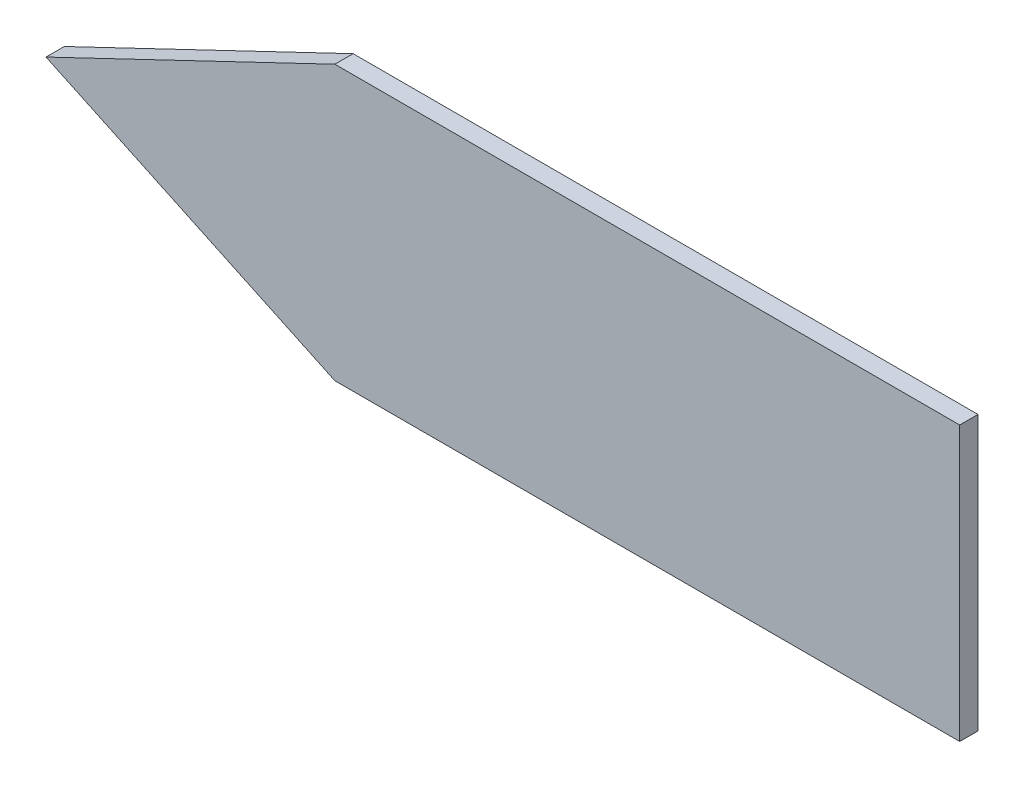
ISO-10303-21;
HEADER;
FILE_DESCRIPTION(('STEP AP214'),'2;1');
FILE_NAME('part.step','',(''),(''),'','','');
FILE_SCHEMA(('AUTOMOTIVE_DESIGN { 1 0 10303 214 1 1 1 1 }'));
ENDSEC;
DATA;
#1=APPLICATION_CONTEXT('core data for automotive mechanical design processes');
#2=APPLICATION_PROTOCOL_DEFINITION('international standard','automotive_design',2000,#1);
#3=PRODUCT_CONTEXT('',#1,'mechanical');
#4=PRODUCT('Part','Part','',(#3));
#5=PRODUCT_RELATED_PRODUCT_CATEGORY('part','',(#4));
#6=PRODUCT_DEFINITION_FORMATION('','',#4);
#7=PRODUCT_DEFINITION_CONTEXT('part definition',#1,'design');
#8=PRODUCT_DEFINITION('design','',#6,#7);
#9=PRODUCT_DEFINITION_SHAPE('','',#8);
#10=(LENGTH_UNIT() NAMED_UNIT(*) SI_UNIT(.MILLI.,.METRE.));
#11=(NAMED_UNIT(*) PLANE_ANGLE_UNIT() SI_UNIT($,.RADIAN.));
#12=(NAMED_UNIT(*) SI_UNIT($,.STERADIAN.) SOLID_ANGLE_UNIT());
#13=UNCERTAINTY_MEASURE_WITH_UNIT(LENGTH_MEASURE(1.E-05),#10,'distance_accuracy_value','');
#14=(GEOMETRIC_REPRESENTATION_CONTEXT(3) GLOBAL_UNCERTAINTY_ASSIGNED_CONTEXT((#13)) GLOBAL_UNIT_ASSIGNED_CONTEXT((#10,
#11,#12)) REPRESENTATION_CONTEXT('',''));
#15=CARTESIAN_POINT('',(0.,0.,0.));
#16=DIRECTION('',(0.,0.,1.));
#17=DIRECTION('',(1.,0.,0.));
#18=AXIS2_PLACEMENT_3D('',#15,#16,#17);
#19=CARTESIAN_POINT('',(0.,0.,1.));
#20=DIRECTION('',(0.42572241959902,0.90485381219883,0.));
#21=DIRECTION('',(-0.90485381219883,0.42572241959902,0.));
#22=AXIS2_PLACEMENT_3D('',#19,#20,#21);
#23=PLANE('',#22);
#24=DIRECTION('',(0.904853812198831,-0.42572241959902,0.));
#25=VECTOR('',#24,1.);
#26=CARTESIAN_POINT('',(0.,0.,0.));
#27=LINE('',#26,#25);
#28=CARTESIAN_POINT('',(0.,0.,0.));
#29=VERTEX_POINT('',#28);
#30=CARTESIAN_POINT('',(15.8068903472595,-7.43694452545779,0.));
#31=VERTEX_POINT('',#30);
#32=EDGE_CURVE('E106',#29,#31,#27,.T.);
#33=ORIENTED_EDGE('',*,*,#32,.T.);
#34=DIRECTION('',(0.,0.,-1.));
#35=VECTOR('',#34,1.);
#36=CARTESIAN_POINT('',(15.8068903472595,-7.43694452545779,1.));
#37=LINE('',#36,#35);
#38=CARTESIAN_POINT('',(15.8068903472595,-7.43694452545779,1.));
#39=VERTEX_POINT('',#38);
#40=EDGE_CURVE('E11',#39,#31,#37,.T.);
#41=ORIENTED_EDGE('',*,*,#40,.F.);
#42=DIRECTION('',(0.904853812198831,-0.42572241959902,0.));
#43=VECTOR('',#42,1.);
#44=CARTESIAN_POINT('',(0.,0.,1.));
#45=LINE('',#44,#43);
#46=CARTESIAN_POINT('',(0.,0.,1.));
#47=VERTEX_POINT('',#46);
#48=EDGE_CURVE('E114',#47,#39,#45,.T.);
#49=ORIENTED_EDGE('',*,*,#48,.F.);
#50=DIRECTION('',(0.,0.,-1.));
#51=VECTOR('',#50,1.);
#52=CARTESIAN_POINT('',(0.,0.,1.));
#53=LINE('',#52,#51);
#54=EDGE_CURVE('E102',#47,#29,#53,.T.);
#55=ORIENTED_EDGE('',*,*,#54,.T.);
#56=EDGE_LOOP('',(#33,#41,#49,#55));
#57=FACE_BOUND('',#56,.T.);
#58=ADVANCED_FACE('F32',(#57),#23,.F.);
#59=CARTESIAN_POINT('',(15.8068903472595,-7.43694452545779,1.));
#60=DIRECTION('',(0.,1.,0.));
#61=DIRECTION('',(0.,0.,1.));
#62=AXIS2_PLACEMENT_3D('',#59,#60,#61);
#63=PLANE('',#62);
#64=DIRECTION('',(1.,0.,0.));
#65=VECTOR('',#64,1.);
#66=CARTESIAN_POINT('',(15.8068903472595,-7.43694452545779,0.));
#67=LINE('',#66,#65);
#68=CARTESIAN_POINT('',(50.,-7.43694452545779,0.));
#69=VERTEX_POINT('',#68);
#70=EDGE_CURVE('E109',#31,#69,#67,.T.);
#71=ORIENTED_EDGE('',*,*,#70,.T.);
#72=DIRECTION('',(0.,0.,-1.));
#73=VECTOR('',#72,1.);
#74=CARTESIAN_POINT('',(50.,-7.43694452545779,1.));
#75=LINE('',#74,#73);
#76=CARTESIAN_POINT('',(50.,-7.43694452545779,1.));
#77=VERTEX_POINT('',#76);
#78=EDGE_CURVE('E40',#77,#69,#75,.T.);
#79=ORIENTED_EDGE('',*,*,#78,.F.);
#80=DIRECTION('',(1.,0.,0.));
#81=VECTOR('',#80,1.);
#82=CARTESIAN_POINT('',(15.8068903472595,-7.43694452545779,1.));
#83=LINE('',#82,#81);
#84=EDGE_CURVE('E82',#39,#77,#83,.T.);
#85=ORIENTED_EDGE('',*,*,#84,.F.);
#86=ORIENTED_EDGE('',*,*,#40,.T.);
#87=EDGE_LOOP('',(#71,#79,#85,#86));
#88=FACE_BOUND('',#87,.T.);
#89=ADVANCED_FACE('F133',(#88),#63,.F.);
#90=CARTESIAN_POINT('',(50.,-7.43694452545779,1.));
#91=DIRECTION('',(-1.,0.,0.));
#92=DIRECTION('',(0.,-1.,0.));
#93=AXIS2_PLACEMENT_3D('',#90,#91,#92);
#94=PLANE('',#93);
#95=DIRECTION('',(0.,1.,0.));
#96=VECTOR('',#95,1.);
#97=CARTESIAN_POINT('',(50.,-7.43694452545779,0.));
#98=LINE('',#97,#96);
#99=CARTESIAN_POINT('',(50.,7.56305547454221,0.));
#100=VERTEX_POINT('',#99);
#101=EDGE_CURVE('E97',#69,#100,#98,.T.);
#102=ORIENTED_EDGE('',*,*,#101,.T.);
#103=DIRECTION('',(0.,0.,-1.));
#104=VECTOR('',#103,1.);
#105=CARTESIAN_POINT('',(50.,7.56305547454221,1.));
#106=LINE('',#105,#104);
#107=CARTESIAN_POINT('',(50.,7.56305547454221,1.));
#108=VERTEX_POINT('',#107);
#109=EDGE_CURVE('E94',#108,#100,#106,.T.);
#110=ORIENTED_EDGE('',*,*,#109,.F.);
#111=DIRECTION('',(0.,1.,0.));
#112=VECTOR('',#111,1.);
#113=CARTESIAN_POINT('',(50.,-7.43694452545779,1.));
#114=LINE('',#113,#112);
#115=EDGE_CURVE('E86',#77,#108,#114,.T.);
#116=ORIENTED_EDGE('',*,*,#115,.F.);
#117=ORIENTED_EDGE('',*,*,#78,.T.);
#118=EDGE_LOOP('',(#102,#110,#116,#117));
#119=FACE_BOUND('',#118,.T.);
#120=ADVANCED_FACE('F95',(#119),#94,.F.);
#121=CARTESIAN_POINT('',(15.8068903472595,7.56305547454221,1.));
#122=DIRECTION('',(0.,-1.,0.));
#123=DIRECTION('',(1.,0.,0.));
#124=AXIS2_PLACEMENT_3D('',#121,#122,#123);
#125=PLANE('',#124);
#126=DIRECTION('',(-1.,0.,0.));
#127=VECTOR('',#126,1.);
#128=CARTESIAN_POINT('',(15.8068903472595,7.56305547454221,0.));
#129=LINE('',#128,#127);
#130=CARTESIAN_POINT('',(15.8068903472595,7.56305547454221,0.));
#131=VERTEX_POINT('',#130);
#132=EDGE_CURVE('E68',#100,#131,#129,.T.);
#133=ORIENTED_EDGE('',*,*,#132,.T.);
#134=DIRECTION('',(0.,0.,-1.));
#135=VECTOR('',#134,1.);
#136=CARTESIAN_POINT('',(15.8068903472595,7.56305547454221,1.));
#137=LINE('',#136,#135);
#138=CARTESIAN_POINT('',(15.8068903472595,7.56305547454221,1.));
#139=VERTEX_POINT('',#138);
#140=EDGE_CURVE('E98',#139,#131,#137,.T.);
#141=ORIENTED_EDGE('',*,*,#140,.F.);
#142=DIRECTION('',(-1.,0.,0.));
#143=VECTOR('',#142,1.);
#144=CARTESIAN_POINT('',(15.8068903472595,7.56305547454221,1.));
#145=LINE('',#144,#143);
#146=EDGE_CURVE('E90',#108,#139,#145,.T.);
#147=ORIENTED_EDGE('',*,*,#146,.F.);
#148=ORIENTED_EDGE('',*,*,#109,.T.);
#149=EDGE_LOOP('',(#133,#141,#147,#148));
#150=FACE_BOUND('',#149,.T.);
#151=ADVANCED_FACE('F100',(#150),#125,.F.);
#152=CARTESIAN_POINT('',(0.,0.,1.));
#153=DIRECTION('',(0.431605894288092,-0.902062277237983,0.));
#154=DIRECTION('',(0.902062277237983,0.431605894288092,0.));
#155=AXIS2_PLACEMENT_3D('',#152,#153,#154);
#156=PLANE('',#155);
#157=DIRECTION('',(-0.902062277237983,-0.431605894288092,0.));
#158=VECTOR('',#157,1.);
#159=CARTESIAN_POINT('',(0.,0.,0.));
#160=LINE('',#159,#158);
#161=EDGE_CURVE('E74',#131,#29,#160,.T.);
#162=ORIENTED_EDGE('',*,*,#161,.T.);
#163=ORIENTED_EDGE('',*,*,#54,.F.);
#164=DIRECTION('',(-0.902062277237983,-0.431605894288092,0.));
#165=VECTOR('',#164,1.);
#166=CARTESIAN_POINT('',(0.,0.,1.));
#167=LINE('',#166,#165);
#168=EDGE_CURVE('E48',#139,#47,#167,.T.);
#169=ORIENTED_EDGE('',*,*,#168,.F.);
#170=ORIENTED_EDGE('',*,*,#140,.T.);
#171=EDGE_LOOP('',(#162,#163,#169,#170));
#172=FACE_BOUND('',#171,.T.);
#173=ADVANCED_FACE('F122',(#172),#156,.F.);
#174=CARTESIAN_POINT('',(0.,0.,1.));
#175=DIRECTION('',(0.,0.,1.));
#176=DIRECTION('',(1.,0.,0.));
#177=AXIS2_PLACEMENT_3D('',#174,#175,#176);
#178=PLANE('',#177);
#179=ORIENTED_EDGE('',*,*,#48,.T.);
#180=ORIENTED_EDGE('',*,*,#84,.T.);
#181=ORIENTED_EDGE('',*,*,#115,.T.);
#182=ORIENTED_EDGE('',*,*,#146,.T.);
#183=ORIENTED_EDGE('',*,*,#168,.T.);
#184=EDGE_LOOP('',(#179,#180,#181,#182,#183));
#185=FACE_BOUND('',#184,.T.);
#186=ADVANCED_FACE('F88',(#185),#178,.T.);
#187=CARTESIAN_POINT('',(0.,0.,0.));
#188=DIRECTION('',(0.,0.,1.));
#189=DIRECTION('',(1.,0.,0.));
#190=AXIS2_PLACEMENT_3D('',#187,#188,#189);
#191=PLANE('',#190);
#192=ORIENTED_EDGE('',*,*,#32,.F.);
#193=ORIENTED_EDGE('',*,*,#161,.F.);
#194=ORIENTED_EDGE('',*,*,#132,.F.);
#195=ORIENTED_EDGE('',*,*,#101,.F.);
#196=ORIENTED_EDGE('',*,*,#70,.F.);
#197=EDGE_LOOP('',(#192,#193,#194,#195,#196));
#198=FACE_BOUND('',#197,.T.);
#199=ADVANCED_FACE('F118',(#198),#191,.F.);
#200=CLOSED_SHELL('',(#58,#89,#120,#151,#173,#186,#199));
#201=MANIFOLD_SOLID_BREP('B2',#200);
#202=ADVANCED_BREP_SHAPE_REPRESENTATION('',(#18,#201),#14);
#203=SHAPE_DEFINITION_REPRESENTATION(#9,#202);
ENDSEC;
END-ISO-10303-21;
